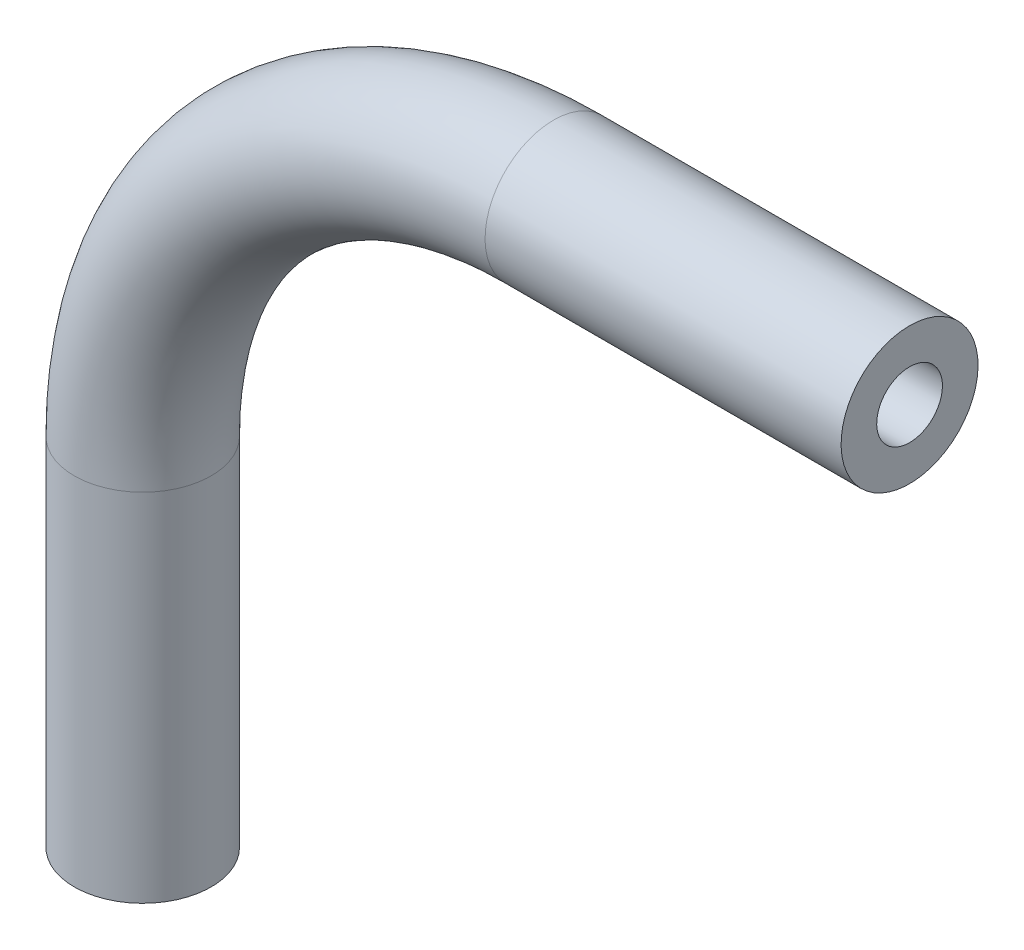
ISO-10303-21;
HEADER;
FILE_DESCRIPTION(('STEP AP214'),'2;1');
FILE_NAME('part.step','',(''),(''),'','','');
FILE_SCHEMA(('AUTOMOTIVE_DESIGN { 1 0 10303 214 1 1 1 1 }'));
ENDSEC;
DATA;
#1=APPLICATION_CONTEXT('core data for automotive mechanical design processes');
#2=APPLICATION_PROTOCOL_DEFINITION('international standard','automotive_design',2000,#1);
#3=PRODUCT_CONTEXT('',#1,'mechanical');
#4=PRODUCT('Part','Part','',(#3));
#5=PRODUCT_RELATED_PRODUCT_CATEGORY('part','',(#4));
#6=PRODUCT_DEFINITION_FORMATION('','',#4);
#7=PRODUCT_DEFINITION_CONTEXT('part definition',#1,'design');
#8=PRODUCT_DEFINITION('design','',#6,#7);
#9=PRODUCT_DEFINITION_SHAPE('','',#8);
#10=(LENGTH_UNIT() NAMED_UNIT(*) SI_UNIT(.MILLI.,.METRE.));
#11=(NAMED_UNIT(*) PLANE_ANGLE_UNIT() SI_UNIT($,.RADIAN.));
#12=(NAMED_UNIT(*) SI_UNIT($,.STERADIAN.) SOLID_ANGLE_UNIT());
#13=UNCERTAINTY_MEASURE_WITH_UNIT(LENGTH_MEASURE(1.E-05),#10,'distance_accuracy_value','');
#14=(GEOMETRIC_REPRESENTATION_CONTEXT(3) GLOBAL_UNCERTAINTY_ASSIGNED_CONTEXT((#13)) GLOBAL_UNIT_ASSIGNED_CONTEXT((#10,
#11,#12)) REPRESENTATION_CONTEXT('',''));
#15=CARTESIAN_POINT('',(0.,0.,0.));
#16=DIRECTION('',(0.,0.,1.));
#17=DIRECTION('',(1.,0.,0.));
#18=AXIS2_PLACEMENT_3D('',#15,#16,#17);
#19=CARTESIAN_POINT('',(0.,-18.0323178807946,0.));
#20=DIRECTION('',(0.,1.,0.));
#21=DIRECTION('',(-1.,0.,0.));
#22=AXIS2_PLACEMENT_3D('',#19,#20,#21);
#23=CYLINDRICAL_SURFACE('',#22,3.175);
#24=CARTESIAN_POINT('',(0.,-1.52231788079484,0.));
#25=DIRECTION('',(0.,1.,0.));
#26=DIRECTION('',(-1.,0.,0.));
#27=AXIS2_PLACEMENT_3D('',#24,#25,#26);
#28=CIRCLE('',#27,3.175);
#29=CARTESIAN_POINT('',(-3.175,-1.52231788079487,0.));
#30=VERTEX_POINT('',#29);
#31=EDGE_CURVE('E90',#30,#30,#28,.T.);
#32=ORIENTED_EDGE('',*,*,#31,.F.);
#33=EDGE_LOOP('',(#32));
#34=FACE_BOUND('',#33,.T.);
#35=CARTESIAN_POINT('',(0.,-18.0323178807946,0.));
#36=DIRECTION('',(0.,1.,0.));
#37=DIRECTION('',(-1.,0.,0.));
#38=AXIS2_PLACEMENT_3D('',#35,#36,#37);
#39=CIRCLE('',#38,3.175);
#40=CARTESIAN_POINT('',(-3.175,-18.0323178807946,0.));
#41=VERTEX_POINT('',#40);
#42=EDGE_CURVE('E55',#41,#41,#39,.T.);
#43=ORIENTED_EDGE('',*,*,#42,.T.);
#44=EDGE_LOOP('',(#43));
#45=FACE_BOUND('',#44,.T.);
#46=ADVANCED_FACE('F39',(#34,#45),#23,.T.);
#47=CARTESIAN_POINT('',(19.05,-1.52231788079469,0.));
#48=DIRECTION('',(0.,0.,-1.));
#49=DIRECTION('',(-1.,0.,0.));
#50=AXIS2_PLACEMENT_3D('',#47,#48,#49);
#51=TOROIDAL_SURFACE('',#50,19.05,3.175);
#52=CARTESIAN_POINT('',(19.0500000000001,17.5276821192053,0.));
#53=DIRECTION('',(1.,0.,0.));
#54=DIRECTION('',(0.,1.,0.));
#55=AXIS2_PLACEMENT_3D('',#52,#53,#54);
#56=CIRCLE('',#55,3.175);
#57=CARTESIAN_POINT('',(19.0500000000001,20.7026821192053,0.));
#58=VERTEX_POINT('',#57);
#59=EDGE_CURVE('E43',#58,#58,#56,.T.);
#60=CARTESIAN_POINT('',(19.05,-1.52231788079469,0.));
#61=DIRECTION('',(0.,0.,-1.));
#62=DIRECTION('',(-1.,0.,0.));
#63=AXIS2_PLACEMENT_3D('',#60,#61,#62);
#64=CIRCLE('',#63,22.225);
#65=EDGE_CURVE('',#30,#58,#64,.T.);
#66=ORIENTED_EDGE('',*,*,#31,.T.);
#67=ORIENTED_EDGE('',*,*,#59,.F.);
#68=ORIENTED_EDGE('',*,*,#65,.T.);
#69=ORIENTED_EDGE('',*,*,#65,.F.);
#70=EDGE_LOOP('',(#66,#68,#67,#69));
#71=FACE_BOUND('',#70,.T.);
#72=ADVANCED_FACE('F100',(#71),#51,.T.);
#73=CARTESIAN_POINT('',(19.0500000000001,17.5276821192053,0.));
#74=DIRECTION('',(1.,0.,0.));
#75=DIRECTION('',(0.,1.,0.));
#76=AXIS2_PLACEMENT_3D('',#73,#74,#75);
#77=CYLINDRICAL_SURFACE('',#76,3.175);
#78=CARTESIAN_POINT('',(35.56,17.5276821192053,0.));
#79=DIRECTION('',(1.,0.,0.));
#80=DIRECTION('',(0.,1.,0.));
#81=AXIS2_PLACEMENT_3D('',#78,#79,#80);
#82=CIRCLE('',#81,3.175);
#83=CARTESIAN_POINT('',(35.56,20.7026821192053,0.));
#84=VERTEX_POINT('',#83);
#85=EDGE_CURVE('E60',#84,#84,#82,.T.);
#86=ORIENTED_EDGE('',*,*,#85,.F.);
#87=EDGE_LOOP('',(#86));
#88=FACE_BOUND('',#87,.T.);
#89=ORIENTED_EDGE('',*,*,#59,.T.);
#90=EDGE_LOOP('',(#89));
#91=FACE_BOUND('',#90,.T.);
#92=ADVANCED_FACE('F41',(#88,#91),#77,.T.);
#93=CARTESIAN_POINT('',(0.,-18.0323178807946,0.));
#94=DIRECTION('',(0.,1.,0.));
#95=DIRECTION('',(-1.,0.,0.));
#96=AXIS2_PLACEMENT_3D('',#93,#94,#95);
#97=PLANE('',#96);
#98=CARTESIAN_POINT('',(0.,-18.0323178807946,0.));
#99=DIRECTION('',(0.,1.,0.));
#100=DIRECTION('',(-1.,0.,0.));
#101=AXIS2_PLACEMENT_3D('',#98,#99,#100);
#102=CIRCLE('',#101,1.524);
#103=CARTESIAN_POINT('',(-1.524,-18.0323178807946,0.));
#104=VERTEX_POINT('',#103);
#105=EDGE_CURVE('E83',#104,#104,#102,.F.);
#106=ORIENTED_EDGE('',*,*,#105,.F.);
#107=EDGE_LOOP('',(#106));
#108=FACE_BOUND('',#107,.T.);
#109=ORIENTED_EDGE('',*,*,#42,.F.);
#110=EDGE_LOOP('',(#109));
#111=FACE_BOUND('',#110,.T.);
#112=ADVANCED_FACE('F106',(#108,#111),#97,.F.);
#113=CARTESIAN_POINT('',(35.56,17.5276821192053,0.));
#114=DIRECTION('',(1.,0.,0.));
#115=DIRECTION('',(0.,1.,0.));
#116=AXIS2_PLACEMENT_3D('',#113,#114,#115);
#117=PLANE('',#116);
#118=CARTESIAN_POINT('',(35.56,17.5276821192053,0.));
#119=DIRECTION('',(1.,0.,0.));
#120=DIRECTION('',(0.,1.,0.));
#121=AXIS2_PLACEMENT_3D('',#118,#119,#120);
#122=CIRCLE('',#121,1.524);
#123=CARTESIAN_POINT('',(35.56,19.0516821192053,0.));
#124=VERTEX_POINT('',#123);
#125=EDGE_CURVE('E11',#124,#124,#122,.F.);
#126=ORIENTED_EDGE('',*,*,#125,.T.);
#127=EDGE_LOOP('',(#126));
#128=FACE_BOUND('',#127,.T.);
#129=ORIENTED_EDGE('',*,*,#85,.T.);
#130=EDGE_LOOP('',(#129));
#131=FACE_BOUND('',#130,.T.);
#132=ADVANCED_FACE('F67',(#128,#131),#117,.T.);
#133=CARTESIAN_POINT('',(0.,-18.0323178807946,0.));
#134=DIRECTION('',(0.,1.,0.));
#135=DIRECTION('',(-1.,0.,0.));
#136=AXIS2_PLACEMENT_3D('',#133,#134,#135);
#137=CYLINDRICAL_SURFACE('',#136,1.524);
#138=CARTESIAN_POINT('',(0.,-1.52231788079484,0.));
#139=DIRECTION('',(0.,1.,0.));
#140=DIRECTION('',(-1.,0.,0.));
#141=AXIS2_PLACEMENT_3D('',#138,#139,#140);
#142=CIRCLE('',#141,1.524);
#143=CARTESIAN_POINT('',(-1.524,-1.52231788079485,0.));
#144=VERTEX_POINT('',#143);
#145=EDGE_CURVE('E79',#144,#144,#142,.F.);
#146=ORIENTED_EDGE('',*,*,#145,.F.);
#147=EDGE_LOOP('',(#146));
#148=FACE_BOUND('',#147,.T.);
#149=ORIENTED_EDGE('',*,*,#105,.T.);
#150=EDGE_LOOP('',(#149));
#151=FACE_BOUND('',#150,.T.);
#152=ADVANCED_FACE('F114',(#148,#151),#137,.F.);
#153=CARTESIAN_POINT('',(19.05,-1.52231788079469,0.));
#154=DIRECTION('',(0.,0.,-1.));
#155=DIRECTION('',(-1.,0.,0.));
#156=AXIS2_PLACEMENT_3D('',#153,#154,#155);
#157=TOROIDAL_SURFACE('',#156,19.05,1.524);
#158=CARTESIAN_POINT('',(19.0500000000001,17.5276821192053,0.));
#159=DIRECTION('',(1.,0.,0.));
#160=DIRECTION('',(0.,1.,0.));
#161=AXIS2_PLACEMENT_3D('',#158,#159,#160);
#162=CIRCLE('',#161,1.524);
#163=CARTESIAN_POINT('',(19.0500000000001,19.0516821192053,0.));
#164=VERTEX_POINT('',#163);
#165=EDGE_CURVE('E49',#164,#164,#162,.F.);
#166=CARTESIAN_POINT('',(19.05,-1.52231788079469,0.));
#167=DIRECTION('',(0.,0.,-1.));
#168=DIRECTION('',(-1.,0.,0.));
#169=AXIS2_PLACEMENT_3D('',#166,#167,#168);
#170=CIRCLE('',#169,20.574);
#171=EDGE_CURVE('',#144,#164,#170,.T.);
#172=ORIENTED_EDGE('',*,*,#145,.T.);
#173=ORIENTED_EDGE('',*,*,#165,.F.);
#174=ORIENTED_EDGE('',*,*,#171,.T.);
#175=ORIENTED_EDGE('',*,*,#171,.F.);
#176=EDGE_LOOP('',(#172,#174,#173,#175));
#177=FACE_BOUND('',#176,.T.);
#178=ADVANCED_FACE('F73',(#177),#157,.F.);
#179=CARTESIAN_POINT('',(19.0500000000001,17.5276821192053,0.));
#180=DIRECTION('',(1.,0.,0.));
#181=DIRECTION('',(0.,1.,0.));
#182=AXIS2_PLACEMENT_3D('',#179,#180,#181);
#183=CYLINDRICAL_SURFACE('',#182,1.524);
#184=ORIENTED_EDGE('',*,*,#125,.F.);
#185=EDGE_LOOP('',(#184));
#186=FACE_BOUND('',#185,.T.);
#187=ORIENTED_EDGE('',*,*,#165,.T.);
#188=EDGE_LOOP('',(#187));
#189=FACE_BOUND('',#188,.T.);
#190=ADVANCED_FACE('F70',(#186,#189),#183,.F.);
#191=CLOSED_SHELL('',(#46,#72,#92,#112,#132,#152,#178,#190));
#192=MANIFOLD_SOLID_BREP('B2',#191);
#193=ADVANCED_BREP_SHAPE_REPRESENTATION('',(#18,#192),#14);
#194=SHAPE_DEFINITION_REPRESENTATION(#9,#193);
ENDSEC;
END-ISO-10303-21;
